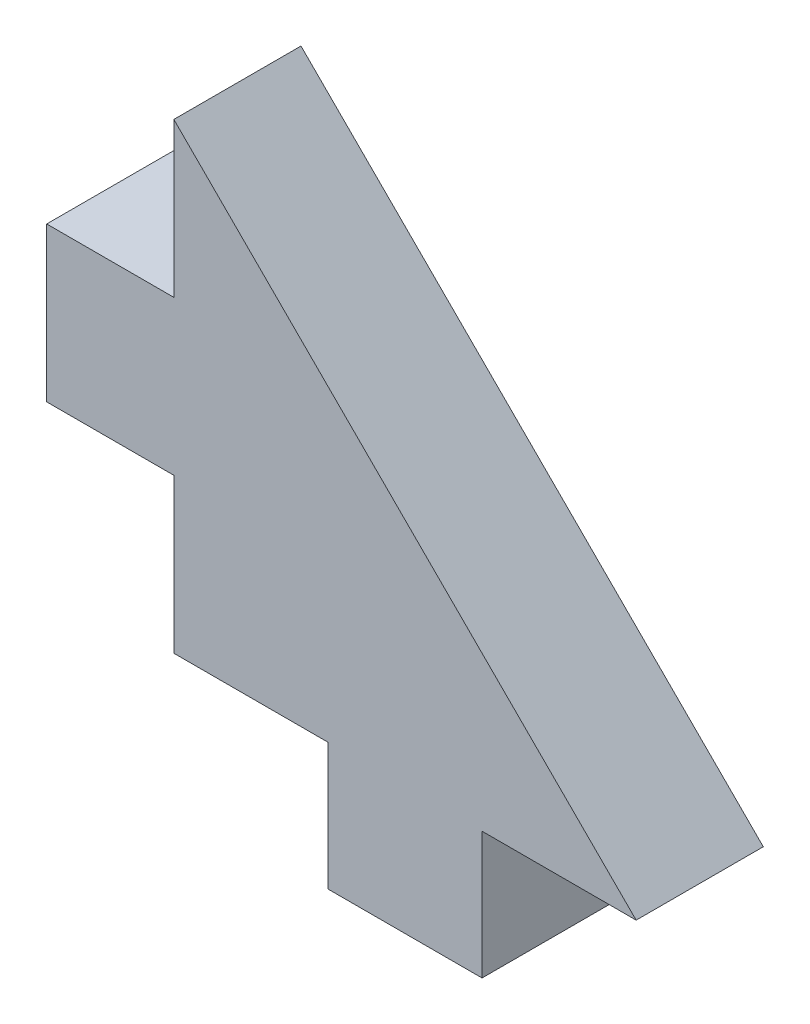
ISO-10303-21;
HEADER;
FILE_DESCRIPTION(('STEP AP214'),'2;1');
FILE_NAME('part.step','',(''),(''),'','','');
FILE_SCHEMA(('AUTOMOTIVE_DESIGN { 1 0 10303 214 1 1 1 1 }'));
ENDSEC;
DATA;
#1=APPLICATION_CONTEXT('core data for automotive mechanical design processes');
#2=APPLICATION_PROTOCOL_DEFINITION('international standard','automotive_design',2000,#1);
#3=PRODUCT_CONTEXT('',#1,'mechanical');
#4=PRODUCT('Part','Part','',(#3));
#5=PRODUCT_RELATED_PRODUCT_CATEGORY('part','',(#4));
#6=PRODUCT_DEFINITION_FORMATION('','',#4);
#7=PRODUCT_DEFINITION_CONTEXT('part definition',#1,'design');
#8=PRODUCT_DEFINITION('design','',#6,#7);
#9=PRODUCT_DEFINITION_SHAPE('','',#8);
#10=(LENGTH_UNIT() NAMED_UNIT(*) SI_UNIT(.MILLI.,.METRE.));
#11=(NAMED_UNIT(*) PLANE_ANGLE_UNIT() SI_UNIT($,.RADIAN.));
#12=(NAMED_UNIT(*) SI_UNIT($,.STERADIAN.) SOLID_ANGLE_UNIT());
#13=UNCERTAINTY_MEASURE_WITH_UNIT(LENGTH_MEASURE(1.E-05),#10,'distance_accuracy_value','');
#14=(GEOMETRIC_REPRESENTATION_CONTEXT(3) GLOBAL_UNCERTAINTY_ASSIGNED_CONTEXT((#13)) GLOBAL_UNIT_ASSIGNED_CONTEXT((#10,
#11,#12)) REPRESENTATION_CONTEXT('',''));
#15=CARTESIAN_POINT('',(0.,0.,0.));
#16=DIRECTION('',(0.,0.,1.));
#17=DIRECTION('',(1.,0.,0.));
#18=AXIS2_PLACEMENT_3D('',#15,#16,#17);
#19=CARTESIAN_POINT('',(0.,0.,5.5));
#20=DIRECTION('',(1.,0.,0.));
#21=DIRECTION('',(0.,0.,-1.));
#22=AXIS2_PLACEMENT_3D('',#19,#20,#21);
#23=PLANE('',#22);
#24=DIRECTION('',(0.,-1.,0.));
#25=VECTOR('',#24,1.);
#26=CARTESIAN_POINT('',(0.,0.,0.));
#27=LINE('',#26,#25);
#28=CARTESIAN_POINT('',(0.,6.66666666666667,0.));
#29=VERTEX_POINT('',#28);
#30=CARTESIAN_POINT('',(0.,0.,0.));
#31=VERTEX_POINT('',#30);
#32=EDGE_CURVE('E145',#29,#31,#27,.T.);
#33=ORIENTED_EDGE('',*,*,#32,.T.);
#34=DIRECTION('',(0.,0.,-1.));
#35=VECTOR('',#34,1.);
#36=CARTESIAN_POINT('',(0.,0.,5.5));
#37=LINE('',#36,#35);
#38=CARTESIAN_POINT('',(0.,0.,5.5));
#39=VERTEX_POINT('',#38);
#40=EDGE_CURVE('E11',#39,#31,#37,.T.);
#41=ORIENTED_EDGE('',*,*,#40,.F.);
#42=DIRECTION('',(0.,-1.,0.));
#43=VECTOR('',#42,1.);
#44=CARTESIAN_POINT('',(0.,0.,5.5));
#45=LINE('',#44,#43);
#46=CARTESIAN_POINT('',(0.,6.66666666666667,5.5));
#47=VERTEX_POINT('',#46);
#48=EDGE_CURVE('E165',#47,#39,#45,.T.);
#49=ORIENTED_EDGE('',*,*,#48,.F.);
#50=DIRECTION('',(0.,0.,-1.));
#51=VECTOR('',#50,1.);
#52=CARTESIAN_POINT('',(0.,6.66666666666667,5.5));
#53=LINE('',#52,#51);
#54=EDGE_CURVE('E141',#47,#29,#53,.T.);
#55=ORIENTED_EDGE('',*,*,#54,.T.);
#56=EDGE_LOOP('',(#33,#41,#49,#55));
#57=FACE_BOUND('',#56,.T.);
#58=ADVANCED_FACE('F31',(#57),#23,.F.);
#59=CARTESIAN_POINT('',(0.,0.,5.5));
#60=DIRECTION('',(0.,1.,0.));
#61=DIRECTION('',(0.,0.,1.));
#62=AXIS2_PLACEMENT_3D('',#59,#60,#61);
#63=PLANE('',#62);
#64=DIRECTION('',(1.,0.,0.));
#65=VECTOR('',#64,1.);
#66=CARTESIAN_POINT('',(0.,0.,0.));
#67=LINE('',#66,#65);
#68=CARTESIAN_POINT('',(6.66666666666667,0.,0.));
#69=VERTEX_POINT('',#68);
#70=EDGE_CURVE('E148',#31,#69,#67,.T.);
#71=ORIENTED_EDGE('',*,*,#70,.T.);
#72=DIRECTION('',(0.,0.,-1.));
#73=VECTOR('',#72,1.);
#74=CARTESIAN_POINT('',(6.66666666666667,0.,5.5));
#75=LINE('',#74,#73);
#76=CARTESIAN_POINT('',(6.66666666666667,0.,5.5));
#77=VERTEX_POINT('',#76);
#78=EDGE_CURVE('E39',#77,#69,#75,.T.);
#79=ORIENTED_EDGE('',*,*,#78,.F.);
#80=DIRECTION('',(1.,0.,0.));
#81=VECTOR('',#80,1.);
#82=CARTESIAN_POINT('',(0.,0.,5.5));
#83=LINE('',#82,#81);
#84=EDGE_CURVE('E99',#39,#77,#83,.T.);
#85=ORIENTED_EDGE('',*,*,#84,.F.);
#86=ORIENTED_EDGE('',*,*,#40,.T.);
#87=EDGE_LOOP('',(#71,#79,#85,#86));
#88=FACE_BOUND('',#87,.T.);
#89=ADVANCED_FACE('F237',(#88),#63,.F.);
#90=CARTESIAN_POINT('',(6.66666666666667,0.,5.5));
#91=DIRECTION('',(1.,0.,0.));
#92=DIRECTION('',(0.,0.,-1.));
#93=AXIS2_PLACEMENT_3D('',#90,#91,#92);
#94=PLANE('',#93);
#95=DIRECTION('',(0.,-1.,0.));
#96=VECTOR('',#95,1.);
#97=CARTESIAN_POINT('',(6.66666666666667,0.,0.));
#98=LINE('',#97,#96);
#99=CARTESIAN_POINT('',(6.66666666666667,-5.5,0.));
#100=VERTEX_POINT('',#99);
#101=EDGE_CURVE('E150',#69,#100,#98,.T.);
#102=ORIENTED_EDGE('',*,*,#101,.T.);
#103=DIRECTION('',(0.,0.,-1.));
#104=VECTOR('',#103,1.);
#105=CARTESIAN_POINT('',(6.66666666666667,-5.5,5.5));
#106=LINE('',#105,#104);
#107=CARTESIAN_POINT('',(6.66666666666667,-5.5,5.5));
#108=VERTEX_POINT('',#107);
#109=EDGE_CURVE('E181',#108,#100,#106,.T.);
#110=ORIENTED_EDGE('',*,*,#109,.F.);
#111=DIRECTION('',(0.,-1.,0.));
#112=VECTOR('',#111,1.);
#113=CARTESIAN_POINT('',(6.66666666666667,0.,5.5));
#114=LINE('',#113,#112);
#115=EDGE_CURVE('E189',#77,#108,#114,.T.);
#116=ORIENTED_EDGE('',*,*,#115,.F.);
#117=ORIENTED_EDGE('',*,*,#78,.T.);
#118=EDGE_LOOP('',(#102,#110,#116,#117));
#119=FACE_BOUND('',#118,.T.);
#120=ADVANCED_FACE('F187',(#119),#94,.F.);
#121=CARTESIAN_POINT('',(6.66666666666667,-5.5,5.5));
#122=DIRECTION('',(0.,1.,0.));
#123=DIRECTION('',(0.,0.,1.));
#124=AXIS2_PLACEMENT_3D('',#121,#122,#123);
#125=PLANE('',#124);
#126=DIRECTION('',(1.,0.,0.));
#127=VECTOR('',#126,1.);
#128=CARTESIAN_POINT('',(6.66666666666667,-5.5,0.));
#129=LINE('',#128,#127);
#130=CARTESIAN_POINT('',(13.3333333333333,-5.5,0.));
#131=VERTEX_POINT('',#130);
#132=EDGE_CURVE('E152',#100,#131,#129,.T.);
#133=ORIENTED_EDGE('',*,*,#132,.T.);
#134=DIRECTION('',(0.,0.,-1.));
#135=VECTOR('',#134,1.);
#136=CARTESIAN_POINT('',(13.3333333333333,-5.5,5.5));
#137=LINE('',#136,#135);
#138=CARTESIAN_POINT('',(13.3333333333333,-5.5,5.5));
#139=VERTEX_POINT('',#138);
#140=EDGE_CURVE('E178',#139,#131,#137,.T.);
#141=ORIENTED_EDGE('',*,*,#140,.F.);
#142=DIRECTION('',(1.,0.,0.));
#143=VECTOR('',#142,1.);
#144=CARTESIAN_POINT('',(6.66666666666667,-5.5,5.5));
#145=LINE('',#144,#143);
#146=EDGE_CURVE('E207',#108,#139,#145,.T.);
#147=ORIENTED_EDGE('',*,*,#146,.F.);
#148=ORIENTED_EDGE('',*,*,#109,.T.);
#149=EDGE_LOOP('',(#133,#141,#147,#148));
#150=FACE_BOUND('',#149,.T.);
#151=ADVANCED_FACE('F198',(#150),#125,.F.);
#152=CARTESIAN_POINT('',(13.3333333333333,0.,5.5));
#153=DIRECTION('',(-1.,0.,0.));
#154=DIRECTION('',(0.,0.,1.));
#155=AXIS2_PLACEMENT_3D('',#152,#153,#154);
#156=PLANE('',#155);
#157=DIRECTION('',(0.,1.,0.));
#158=VECTOR('',#157,1.);
#159=CARTESIAN_POINT('',(13.3333333333333,0.,0.));
#160=LINE('',#159,#158);
#161=CARTESIAN_POINT('',(13.3333333333333,0.,0.));
#162=VERTEX_POINT('',#161);
#163=EDGE_CURVE('E154',#131,#162,#160,.T.);
#164=ORIENTED_EDGE('',*,*,#163,.T.);
#165=DIRECTION('',(0.,0.,-1.));
#166=VECTOR('',#165,1.);
#167=CARTESIAN_POINT('',(13.3333333333333,0.,5.5));
#168=LINE('',#167,#166);
#169=CARTESIAN_POINT('',(13.3333333333333,0.,5.5));
#170=VERTEX_POINT('',#169);
#171=EDGE_CURVE('E175',#170,#162,#168,.T.);
#172=ORIENTED_EDGE('',*,*,#171,.F.);
#173=DIRECTION('',(0.,1.,0.));
#174=VECTOR('',#173,1.);
#175=CARTESIAN_POINT('',(13.3333333333333,0.,5.5));
#176=LINE('',#175,#174);
#177=EDGE_CURVE('E204',#139,#170,#176,.T.);
#178=ORIENTED_EDGE('',*,*,#177,.F.);
#179=ORIENTED_EDGE('',*,*,#140,.T.);
#180=EDGE_LOOP('',(#164,#172,#178,#179));
#181=FACE_BOUND('',#180,.T.);
#182=ADVANCED_FACE('F202',(#181),#156,.F.);
#183=CARTESIAN_POINT('',(13.3333333333333,0.,5.5));
#184=DIRECTION('',(0.,1.,0.));
#185=DIRECTION('',(0.,0.,1.));
#186=AXIS2_PLACEMENT_3D('',#183,#184,#185);
#187=PLANE('',#186);
#188=DIRECTION('',(1.,0.,0.));
#189=VECTOR('',#188,1.);
#190=CARTESIAN_POINT('',(13.3333333333333,0.,0.));
#191=LINE('',#190,#189);
#192=CARTESIAN_POINT('',(20.,0.,0.));
#193=VERTEX_POINT('',#192);
#194=EDGE_CURVE('E156',#162,#193,#191,.T.);
#195=ORIENTED_EDGE('',*,*,#194,.T.);
#196=DIRECTION('',(0.,0.,-1.));
#197=VECTOR('',#196,1.);
#198=CARTESIAN_POINT('',(20.,0.,5.5));
#199=LINE('',#198,#197);
#200=CARTESIAN_POINT('',(20.,0.,5.5));
#201=VERTEX_POINT('',#200);
#202=EDGE_CURVE('E172',#201,#193,#199,.T.);
#203=ORIENTED_EDGE('',*,*,#202,.F.);
#204=DIRECTION('',(1.,0.,0.));
#205=VECTOR('',#204,1.);
#206=CARTESIAN_POINT('',(13.3333333333333,0.,5.5));
#207=LINE('',#206,#205);
#208=EDGE_CURVE('E206',#170,#201,#207,.T.);
#209=ORIENTED_EDGE('',*,*,#208,.F.);
#210=ORIENTED_EDGE('',*,*,#171,.T.);
#211=EDGE_LOOP('',(#195,#203,#209,#210));
#212=FACE_BOUND('',#211,.T.);
#213=ADVANCED_FACE('F250',(#212),#187,.F.);
#214=CARTESIAN_POINT('',(0.,20.,5.5));
#215=DIRECTION('',(-0.707106781186548,-0.707106781186548,0.));
#216=DIRECTION('',(0.707106781186548,-0.707106781186548,0.));
#217=AXIS2_PLACEMENT_3D('',#214,#215,#216);
#218=PLANE('',#217);
#219=DIRECTION('',(-0.707106781186548,0.707106781186548,0.));
#220=VECTOR('',#219,1.);
#221=CARTESIAN_POINT('',(0.,20.,0.));
#222=LINE('',#221,#220);
#223=CARTESIAN_POINT('',(0.,20.,0.));
#224=VERTEX_POINT('',#223);
#225=EDGE_CURVE('E158',#193,#224,#222,.T.);
#226=ORIENTED_EDGE('',*,*,#225,.T.);
#227=DIRECTION('',(0.,0.,-1.));
#228=VECTOR('',#227,1.);
#229=CARTESIAN_POINT('',(0.,20.,5.5));
#230=LINE('',#229,#228);
#231=CARTESIAN_POINT('',(0.,20.,5.5));
#232=VERTEX_POINT('',#231);
#233=EDGE_CURVE('E169',#232,#224,#230,.T.);
#234=ORIENTED_EDGE('',*,*,#233,.F.);
#235=DIRECTION('',(-0.707106781186548,0.707106781186548,0.));
#236=VECTOR('',#235,1.);
#237=CARTESIAN_POINT('',(0.,20.,5.5));
#238=LINE('',#237,#236);
#239=EDGE_CURVE('E209',#201,#232,#238,.T.);
#240=ORIENTED_EDGE('',*,*,#239,.F.);
#241=ORIENTED_EDGE('',*,*,#202,.T.);
#242=EDGE_LOOP('',(#226,#234,#240,#241));
#243=FACE_BOUND('',#242,.T.);
#244=ADVANCED_FACE('F218',(#243),#218,.F.);
#245=CARTESIAN_POINT('',(0.,13.3333333333333,5.5));
#246=DIRECTION('',(1.,0.,0.));
#247=DIRECTION('',(0.,0.,-1.));
#248=AXIS2_PLACEMENT_3D('',#245,#246,#247);
#249=PLANE('',#248);
#250=DIRECTION('',(0.,-1.,0.));
#251=VECTOR('',#250,1.);
#252=CARTESIAN_POINT('',(0.,13.3333333333333,0.));
#253=LINE('',#252,#251);
#254=CARTESIAN_POINT('',(0.,13.3333333333333,0.));
#255=VERTEX_POINT('',#254);
#256=EDGE_CURVE('E160',#224,#255,#253,.T.);
#257=ORIENTED_EDGE('',*,*,#256,.T.);
#258=DIRECTION('',(0.,0.,-1.));
#259=VECTOR('',#258,1.);
#260=CARTESIAN_POINT('',(0.,13.3333333333333,5.5));
#261=LINE('',#260,#259);
#262=CARTESIAN_POINT('',(0.,13.3333333333333,5.5));
#263=VERTEX_POINT('',#262);
#264=EDGE_CURVE('E136',#263,#255,#261,.T.);
#265=ORIENTED_EDGE('',*,*,#264,.F.);
#266=DIRECTION('',(0.,-1.,0.));
#267=VECTOR('',#266,1.);
#268=CARTESIAN_POINT('',(0.,13.3333333333333,5.5));
#269=LINE('',#268,#267);
#270=EDGE_CURVE('E127',#232,#263,#269,.T.);
#271=ORIENTED_EDGE('',*,*,#270,.F.);
#272=ORIENTED_EDGE('',*,*,#233,.T.);
#273=EDGE_LOOP('',(#257,#265,#271,#272));
#274=FACE_BOUND('',#273,.T.);
#275=ADVANCED_FACE('F222',(#274),#249,.F.);
#276=CARTESIAN_POINT('',(0.,13.3333333333333,5.5));
#277=DIRECTION('',(0.,-1.,0.));
#278=DIRECTION('',(0.,0.,-1.));
#279=AXIS2_PLACEMENT_3D('',#276,#277,#278);
#280=PLANE('',#279);
#281=DIRECTION('',(-1.,0.,0.));
#282=VECTOR('',#281,1.);
#283=CARTESIAN_POINT('',(0.,13.3333333333333,0.));
#284=LINE('',#283,#282);
#285=CARTESIAN_POINT('',(-5.5,13.3333333333333,0.));
#286=VERTEX_POINT('',#285);
#287=EDGE_CURVE('E135',#255,#286,#284,.T.);
#288=ORIENTED_EDGE('',*,*,#287,.T.);
#289=DIRECTION('',(0.,0.,-1.));
#290=VECTOR('',#289,1.);
#291=CARTESIAN_POINT('',(-5.5,13.3333333333333,5.5));
#292=LINE('',#291,#290);
#293=CARTESIAN_POINT('',(-5.5,13.3333333333333,5.5));
#294=VERTEX_POINT('',#293);
#295=EDGE_CURVE('E132',#294,#286,#292,.T.);
#296=ORIENTED_EDGE('',*,*,#295,.F.);
#297=DIRECTION('',(-1.,0.,0.));
#298=VECTOR('',#297,1.);
#299=CARTESIAN_POINT('',(0.,13.3333333333333,5.5));
#300=LINE('',#299,#298);
#301=EDGE_CURVE('E121',#263,#294,#300,.T.);
#302=ORIENTED_EDGE('',*,*,#301,.F.);
#303=ORIENTED_EDGE('',*,*,#264,.T.);
#304=EDGE_LOOP('',(#288,#296,#302,#303));
#305=FACE_BOUND('',#304,.T.);
#306=ADVANCED_FACE('F133',(#305),#280,.F.);
#307=CARTESIAN_POINT('',(-5.5,13.3333333333333,5.5));
#308=DIRECTION('',(1.,0.,0.));
#309=DIRECTION('',(0.,0.,-1.));
#310=AXIS2_PLACEMENT_3D('',#307,#308,#309);
#311=PLANE('',#310);
#312=DIRECTION('',(0.,-1.,0.));
#313=VECTOR('',#312,1.);
#314=CARTESIAN_POINT('',(-5.5,13.3333333333333,0.));
#315=LINE('',#314,#313);
#316=CARTESIAN_POINT('',(-5.5,6.66666666666667,0.));
#317=VERTEX_POINT('',#316);
#318=EDGE_CURVE('E85',#286,#317,#315,.T.);
#319=ORIENTED_EDGE('',*,*,#318,.T.);
#320=DIRECTION('',(0.,0.,-1.));
#321=VECTOR('',#320,1.);
#322=CARTESIAN_POINT('',(-5.5,6.66666666666667,5.5));
#323=LINE('',#322,#321);
#324=CARTESIAN_POINT('',(-5.5,6.66666666666667,5.5));
#325=VERTEX_POINT('',#324);
#326=EDGE_CURVE('E137',#325,#317,#323,.T.);
#327=ORIENTED_EDGE('',*,*,#326,.F.);
#328=DIRECTION('',(0.,-1.,0.));
#329=VECTOR('',#328,1.);
#330=CARTESIAN_POINT('',(-5.5,13.3333333333333,5.5));
#331=LINE('',#330,#329);
#332=EDGE_CURVE('E125',#294,#325,#331,.T.);
#333=ORIENTED_EDGE('',*,*,#332,.F.);
#334=ORIENTED_EDGE('',*,*,#295,.T.);
#335=EDGE_LOOP('',(#319,#327,#333,#334));
#336=FACE_BOUND('',#335,.T.);
#337=ADVANCED_FACE('F139',(#336),#311,.F.);
#338=CARTESIAN_POINT('',(0.,6.66666666666667,5.5));
#339=DIRECTION('',(0.,1.,0.));
#340=DIRECTION('',(-1.,0.,0.));
#341=AXIS2_PLACEMENT_3D('',#338,#339,#340);
#342=PLANE('',#341);
#343=DIRECTION('',(1.,0.,0.));
#344=VECTOR('',#343,1.);
#345=CARTESIAN_POINT('',(0.,6.66666666666667,0.));
#346=LINE('',#345,#344);
#347=EDGE_CURVE('E91',#317,#29,#346,.T.);
#348=ORIENTED_EDGE('',*,*,#347,.T.);
#349=ORIENTED_EDGE('',*,*,#54,.F.);
#350=DIRECTION('',(1.,0.,0.));
#351=VECTOR('',#350,1.);
#352=CARTESIAN_POINT('',(0.,6.66666666666667,5.5));
#353=LINE('',#352,#351);
#354=EDGE_CURVE('E47',#325,#47,#353,.T.);
#355=ORIENTED_EDGE('',*,*,#354,.F.);
#356=ORIENTED_EDGE('',*,*,#326,.T.);
#357=EDGE_LOOP('',(#348,#349,#355,#356));
#358=FACE_BOUND('',#357,.T.);
#359=ADVANCED_FACE('F226',(#358),#342,.F.);
#360=CARTESIAN_POINT('',(0.,6.66666666666667,5.5));
#361=DIRECTION('',(0.,0.,1.));
#362=DIRECTION('',(1.,0.,0.));
#363=AXIS2_PLACEMENT_3D('',#360,#361,#362);
#364=PLANE('',#363);
#365=ORIENTED_EDGE('',*,*,#48,.T.);
#366=ORIENTED_EDGE('',*,*,#84,.T.);
#367=ORIENTED_EDGE('',*,*,#115,.T.);
#368=ORIENTED_EDGE('',*,*,#146,.T.);
#369=ORIENTED_EDGE('',*,*,#177,.T.);
#370=ORIENTED_EDGE('',*,*,#208,.T.);
#371=ORIENTED_EDGE('',*,*,#239,.T.);
#372=ORIENTED_EDGE('',*,*,#270,.T.);
#373=ORIENTED_EDGE('',*,*,#301,.T.);
#374=ORIENTED_EDGE('',*,*,#332,.T.);
#375=ORIENTED_EDGE('',*,*,#354,.T.);
#376=EDGE_LOOP('',(#365,#366,#367,#368,#369,#370,#371,#372,#373,#374,#375));
#377=FACE_BOUND('',#376,.T.);
#378=ADVANCED_FACE('F123',(#377),#364,.T.);
#379=CARTESIAN_POINT('',(0.,6.66666666666667,0.));
#380=DIRECTION('',(0.,0.,1.));
#381=DIRECTION('',(1.,0.,0.));
#382=AXIS2_PLACEMENT_3D('',#379,#380,#381);
#383=PLANE('',#382);
#384=ORIENTED_EDGE('',*,*,#32,.F.);
#385=ORIENTED_EDGE('',*,*,#347,.F.);
#386=ORIENTED_EDGE('',*,*,#318,.F.);
#387=ORIENTED_EDGE('',*,*,#287,.F.);
#388=ORIENTED_EDGE('',*,*,#256,.F.);
#389=ORIENTED_EDGE('',*,*,#225,.F.);
#390=ORIENTED_EDGE('',*,*,#194,.F.);
#391=ORIENTED_EDGE('',*,*,#163,.F.);
#392=ORIENTED_EDGE('',*,*,#132,.F.);
#393=ORIENTED_EDGE('',*,*,#101,.F.);
#394=ORIENTED_EDGE('',*,*,#70,.F.);
#395=EDGE_LOOP('',(#384,#385,#386,#387,#388,#389,#390,#391,#392,#393,#394));
#396=FACE_BOUND('',#395,.T.);
#397=ADVANCED_FACE('F193',(#396),#383,.F.);
#398=CLOSED_SHELL('',(#58,#89,#120,#151,#182,#213,#244,#275,#306,#337,#359,#378,#397));
#399=MANIFOLD_SOLID_BREP('B2',#398);
#400=ADVANCED_BREP_SHAPE_REPRESENTATION('',(#18,#399),#14);
#401=SHAPE_DEFINITION_REPRESENTATION(#9,#400);
ENDSEC;
END-ISO-10303-21;
